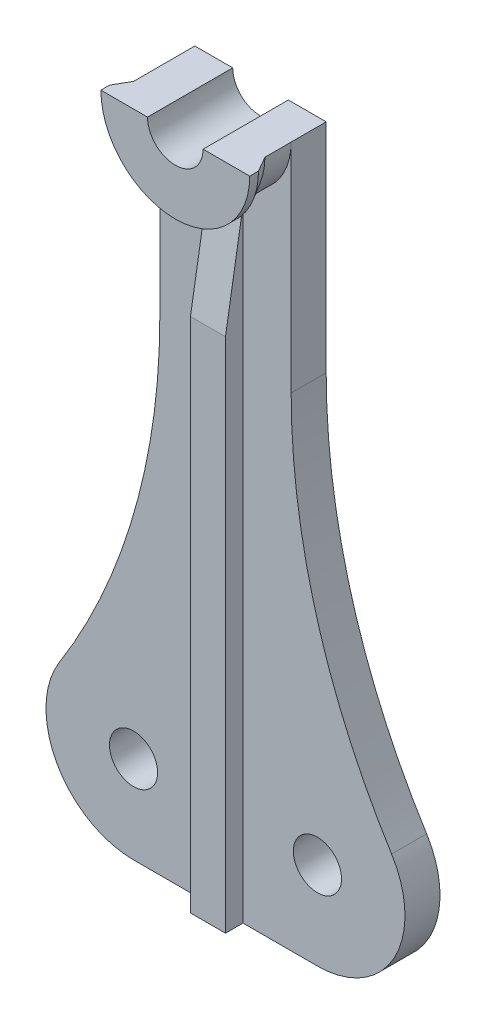
ISO-10303-21;
HEADER;
FILE_DESCRIPTION(('STEP AP214'),'2;1');
FILE_NAME('part.step','',(''),(''),'','','');
FILE_SCHEMA(('AUTOMOTIVE_DESIGN { 1 0 10303 214 1 1 1 1 }'));
ENDSEC;
DATA;
#1=APPLICATION_CONTEXT('core data for automotive mechanical design processes');
#2=APPLICATION_PROTOCOL_DEFINITION('international standard','automotive_design',2000,#1);
#3=PRODUCT_CONTEXT('',#1,'mechanical');
#4=PRODUCT('Part','Part','',(#3));
#5=PRODUCT_RELATED_PRODUCT_CATEGORY('part','',(#4));
#6=PRODUCT_DEFINITION_FORMATION('','',#4);
#7=PRODUCT_DEFINITION_CONTEXT('part definition',#1,'design');
#8=PRODUCT_DEFINITION('design','',#6,#7);
#9=PRODUCT_DEFINITION_SHAPE('','',#8);
#10=(LENGTH_UNIT() NAMED_UNIT(*) SI_UNIT(.MILLI.,.METRE.));
#11=(NAMED_UNIT(*) PLANE_ANGLE_UNIT() SI_UNIT($,.RADIAN.));
#12=(NAMED_UNIT(*) SI_UNIT($,.STERADIAN.) SOLID_ANGLE_UNIT());
#13=UNCERTAINTY_MEASURE_WITH_UNIT(LENGTH_MEASURE(1.E-05),#10,'distance_accuracy_value','');
#14=(GEOMETRIC_REPRESENTATION_CONTEXT(3) GLOBAL_UNCERTAINTY_ASSIGNED_CONTEXT((#13)) GLOBAL_UNIT_ASSIGNED_CONTEXT((#10,
#11,#12)) REPRESENTATION_CONTEXT('',''));
#15=CARTESIAN_POINT('',(0.,0.,0.));
#16=DIRECTION('',(0.,0.,1.));
#17=DIRECTION('',(1.,0.,0.));
#18=AXIS2_PLACEMENT_3D('',#15,#16,#17);
#19=CARTESIAN_POINT('',(-7.5,0.,4.));
#20=DIRECTION('',(1.,0.,0.));
#21=DIRECTION('',(0.,1.,0.));
#22=AXIS2_PLACEMENT_3D('',#19,#20,#21);
#23=PLANE('',#22);
#24=DIRECTION('',(0.,0.,1.));
#25=VECTOR('',#24,1.);
#26=CARTESIAN_POINT('',(-7.50000000000002,-24.8225720076939,-41.4799739066229));
#27=LINE('',#26,#25);
#28=CARTESIAN_POINT('',(-7.5,-24.8225720076939,0.));
#29=VERTEX_POINT('',#28);
#30=CARTESIAN_POINT('',(-7.5,-24.8225720076939,4.));
#31=VERTEX_POINT('',#30);
#32=EDGE_CURVE('E48',#29,#31,#27,.T.);
#33=ORIENTED_EDGE('',*,*,#32,.T.);
#34=DIRECTION('',(0.,-1.,0.));
#35=VECTOR('',#34,1.);
#36=CARTESIAN_POINT('',(-7.5,0.,4.));
#37=LINE('',#36,#35);
#38=CARTESIAN_POINT('',(-7.5,0.,4.));
#39=VERTEX_POINT('',#38);
#40=EDGE_CURVE('E265',#39,#31,#37,.T.);
#41=ORIENTED_EDGE('',*,*,#40,.F.);
#42=DIRECTION('',(0.,0.,-1.));
#43=VECTOR('',#42,1.);
#44=CARTESIAN_POINT('',(-7.5,0.,4.));
#45=LINE('',#44,#43);
#46=CARTESIAN_POINT('',(-7.5,0.,0.));
#47=VERTEX_POINT('',#46);
#48=EDGE_CURVE('E11',#39,#47,#45,.T.);
#49=ORIENTED_EDGE('',*,*,#48,.T.);
#50=DIRECTION('',(0.,-1.,0.));
#51=VECTOR('',#50,1.);
#52=CARTESIAN_POINT('',(-7.5,0.,0.));
#53=LINE('',#52,#51);
#54=EDGE_CURVE('E52',#47,#29,#53,.T.);
#55=ORIENTED_EDGE('',*,*,#54,.T.);
#56=EDGE_LOOP('',(#33,#41,#49,#55));
#57=FACE_BOUND('',#56,.T.);
#58=ADVANCED_FACE('F33',(#57),#23,.F.);
#59=CARTESIAN_POINT('',(-10.5,-70.,4.));
#60=DIRECTION('',(0.,0.,-1.));
#61=DIRECTION('',(-1.,0.,0.));
#62=AXIS2_PLACEMENT_3D('',#59,#60,#61);
#63=CYLINDRICAL_SURFACE('',#62,10.);
#64=DIRECTION('',(0.,0.,1.));
#65=VECTOR('',#64,1.);
#66=CARTESIAN_POINT('',(-18.9705882352941,-64.6850084714934,-41.4799739066229));
#67=LINE('',#66,#65);
#68=CARTESIAN_POINT('',(-18.9705882352941,-64.6850084714934,0.));
#69=VERTEX_POINT('',#68);
#70=CARTESIAN_POINT('',(-18.9705882352941,-64.6850084714934,4.));
#71=VERTEX_POINT('',#70);
#72=EDGE_CURVE('E164',#69,#71,#67,.T.);
#73=ORIENTED_EDGE('',*,*,#72,.F.);
#74=CARTESIAN_POINT('',(-10.5,-70.,0.));
#75=DIRECTION('',(0.,0.,1.));
#76=DIRECTION('',(1.,0.,0.));
#77=AXIS2_PLACEMENT_3D('',#74,#75,#76);
#78=CIRCLE('',#77,10.);
#79=CARTESIAN_POINT('',(-10.5,-80.,0.));
#80=VERTEX_POINT('',#79);
#81=EDGE_CURVE('E150',#69,#80,#78,.T.);
#82=ORIENTED_EDGE('',*,*,#81,.T.);
#83=DIRECTION('',(0.,0.,-1.));
#84=VECTOR('',#83,1.);
#85=CARTESIAN_POINT('',(-10.5,-80.,4.));
#86=LINE('',#85,#84);
#87=CARTESIAN_POINT('',(-10.5,-80.,4.));
#88=VERTEX_POINT('',#87);
#89=EDGE_CURVE('E41',#88,#80,#86,.T.);
#90=ORIENTED_EDGE('',*,*,#89,.F.);
#91=CARTESIAN_POINT('',(-10.5,-70.,4.));
#92=DIRECTION('',(0.,0.,1.));
#93=DIRECTION('',(1.,0.,0.));
#94=AXIS2_PLACEMENT_3D('',#91,#92,#93);
#95=CIRCLE('',#94,10.);
#96=EDGE_CURVE('E166',#71,#88,#95,.T.);
#97=ORIENTED_EDGE('',*,*,#96,.F.);
#98=EDGE_LOOP('',(#73,#82,#90,#97));
#99=FACE_BOUND('',#98,.T.);
#100=ADVANCED_FACE('F165',(#99),#63,.T.);
#101=CARTESIAN_POINT('',(0.,0.,4.));
#102=DIRECTION('',(0.,0.,1.));
#103=DIRECTION('',(1.,0.,0.));
#104=AXIS2_PLACEMENT_3D('',#101,#102,#103);
#105=PLANE('',#104);
#106=ORIENTED_EDGE('',*,*,#40,.T.);
#107=CARTESIAN_POINT('',(-82.5,-24.8225720076939,4.));
#108=DIRECTION('',(0.,0.,-1.));
#109=DIRECTION('',(1.,0.,0.));
#110=AXIS2_PLACEMENT_3D('',#107,#108,#109);
#111=CIRCLE('',#110,75.);
#112=EDGE_CURVE('E170',#31,#71,#111,.T.);
#113=ORIENTED_EDGE('',*,*,#112,.T.);
#114=ORIENTED_EDGE('',*,*,#96,.T.);
#115=DIRECTION('',(1.,0.,0.));
#116=VECTOR('',#115,1.);
#117=CARTESIAN_POINT('',(10.5,-80.,4.));
#118=LINE('',#117,#116);
#119=CARTESIAN_POINT('',(-2.,-80.,4.));
#120=VERTEX_POINT('',#119);
#121=EDGE_CURVE('E270',#88,#120,#118,.T.);
#122=ORIENTED_EDGE('',*,*,#121,.T.);
#123=DIRECTION('',(0.,1.,0.));
#124=VECTOR('',#123,1.);
#125=CARTESIAN_POINT('',(-2.,-80.,4.));
#126=LINE('',#125,#124);
#127=CARTESIAN_POINT('',(-2.,-9.,4.));
#128=VERTEX_POINT('',#127);
#129=EDGE_CURVE('E183',#120,#128,#126,.T.);
#130=ORIENTED_EDGE('',*,*,#129,.T.);
#131=DIRECTION('',(-1.,0.,0.));
#132=VECTOR('',#131,1.);
#133=CARTESIAN_POINT('',(2.,-9.,4.));
#134=LINE('',#133,#132);
#135=CARTESIAN_POINT('',(2.,-9.,4.));
#136=VERTEX_POINT('',#135);
#137=EDGE_CURVE('E213',#136,#128,#134,.T.);
#138=ORIENTED_EDGE('',*,*,#137,.F.);
#139=DIRECTION('',(0.,1.,0.));
#140=VECTOR('',#139,1.);
#141=CARTESIAN_POINT('',(2.,-80.,4.));
#142=LINE('',#141,#140);
#143=CARTESIAN_POINT('',(2.,-80.,4.));
#144=VERTEX_POINT('',#143);
#145=EDGE_CURVE('E189',#144,#136,#142,.T.);
#146=ORIENTED_EDGE('',*,*,#145,.F.);
#147=CARTESIAN_POINT('',(10.5,-80.,4.));
#148=VERTEX_POINT('',#147);
#149=EDGE_CURVE('E269',#144,#148,#118,.T.);
#150=ORIENTED_EDGE('',*,*,#149,.T.);
#151=CARTESIAN_POINT('',(10.5,-70.,4.));
#152=DIRECTION('',(0.,0.,1.));
#153=DIRECTION('',(1.,0.,0.));
#154=AXIS2_PLACEMENT_3D('',#151,#152,#153);
#155=CIRCLE('',#154,10.);
#156=CARTESIAN_POINT('',(18.9705882352941,-64.6850084714934,4.));
#157=VERTEX_POINT('',#156);
#158=EDGE_CURVE('E272',#148,#157,#155,.T.);
#159=ORIENTED_EDGE('',*,*,#158,.T.);
#160=CARTESIAN_POINT('',(82.5,-24.8225720076939,4.));
#161=DIRECTION('',(0.,0.,-1.));
#162=DIRECTION('',(1.,0.,0.));
#163=AXIS2_PLACEMENT_3D('',#160,#161,#162);
#164=CIRCLE('',#163,75.);
#165=CARTESIAN_POINT('',(7.5,-24.8225720076939,4.));
#166=VERTEX_POINT('',#165);
#167=EDGE_CURVE('E173',#157,#166,#164,.T.);
#168=ORIENTED_EDGE('',*,*,#167,.T.);
#169=DIRECTION('',(0.,1.,0.));
#170=VECTOR('',#169,1.);
#171=CARTESIAN_POINT('',(7.5,0.,4.));
#172=LINE('',#171,#170);
#173=CARTESIAN_POINT('',(7.5,0.,4.));
#174=VERTEX_POINT('',#173);
#175=EDGE_CURVE('E275',#166,#174,#172,.T.);
#176=ORIENTED_EDGE('',*,*,#175,.T.);
#177=CARTESIAN_POINT('',(0.,0.,4.));
#178=DIRECTION('',(0.,0.,1.));
#179=DIRECTION('',(1.,0.,0.));
#180=AXIS2_PLACEMENT_3D('',#177,#178,#179);
#181=CIRCLE('',#180,7.5);
#182=EDGE_CURVE('E249',#39,#174,#181,.T.);
#183=ORIENTED_EDGE('',*,*,#182,.F.);
#184=EDGE_LOOP('',(#106,#113,#114,#122,#130,#138,#146,#150,#159,#168,#176,#183));
#185=FACE_BOUND('',#184,.T.);
#186=CARTESIAN_POINT('',(10.5,-70.,4.));
#187=DIRECTION('',(0.,0.,1.));
#188=DIRECTION('',(1.,0.,0.));
#189=AXIS2_PLACEMENT_3D('',#186,#187,#188);
#190=CIRCLE('',#189,2.75);
#191=CARTESIAN_POINT('',(13.25,-70.,4.));
#192=VERTEX_POINT('',#191);
#193=EDGE_CURVE('E253',#192,#192,#190,.T.);
#194=ORIENTED_EDGE('',*,*,#193,.F.);
#195=EDGE_LOOP('',(#194));
#196=FACE_BOUND('',#195,.T.);
#197=CARTESIAN_POINT('',(-10.5,-70.,4.));
#198=DIRECTION('',(0.,0.,1.));
#199=DIRECTION('',(1.,0.,0.));
#200=AXIS2_PLACEMENT_3D('',#197,#198,#199);
#201=CIRCLE('',#200,2.75);
#202=CARTESIAN_POINT('',(-7.74999999999999,-70.,4.));
#203=VERTEX_POINT('',#202);
#204=EDGE_CURVE('E259',#203,#203,#201,.T.);
#205=ORIENTED_EDGE('',*,*,#204,.F.);
#206=EDGE_LOOP('',(#205));
#207=FACE_BOUND('',#206,.T.);
#208=ADVANCED_FACE('F306',(#185,#196,#207),#105,.T.);
#209=CARTESIAN_POINT('',(0.,0.,0.));
#210=DIRECTION('',(0.,0.,1.));
#211=DIRECTION('',(1.,0.,0.));
#212=AXIS2_PLACEMENT_3D('',#209,#210,#211);
#213=PLANE('',#212);
#214=CARTESIAN_POINT('',(-10.5,-70.,0.));
#215=DIRECTION('',(0.,0.,1.));
#216=DIRECTION('',(1.,0.,0.));
#217=AXIS2_PLACEMENT_3D('',#214,#215,#216);
#218=CIRCLE('',#217,2.75);
#219=CARTESIAN_POINT('',(-7.74999999999999,-70.,0.));
#220=VERTEX_POINT('',#219);
#221=EDGE_CURVE('E256',#220,#220,#218,.T.);
#222=ORIENTED_EDGE('',*,*,#221,.T.);
#223=EDGE_LOOP('',(#222));
#224=FACE_BOUND('',#223,.T.);
#225=DIRECTION('',(-1.,0.,0.));
#226=VECTOR('',#225,1.);
#227=CARTESIAN_POINT('',(-7.5,0.,0.));
#228=LINE('',#227,#226);
#229=CARTESIAN_POINT('',(-3.175,0.,0.));
#230=VERTEX_POINT('',#229);
#231=EDGE_CURVE('E262',#230,#47,#228,.T.);
#232=ORIENTED_EDGE('',*,*,#231,.F.);
#233=CARTESIAN_POINT('',(0.,0.,0.));
#234=DIRECTION('',(0.,0.,-1.));
#235=DIRECTION('',(1.,0.,0.));
#236=AXIS2_PLACEMENT_3D('',#233,#234,#235);
#237=CIRCLE('',#236,3.175);
#238=CARTESIAN_POINT('',(3.175,0.,0.));
#239=VERTEX_POINT('',#238);
#240=EDGE_CURVE('E267',#239,#230,#237,.T.);
#241=ORIENTED_EDGE('',*,*,#240,.F.);
#242=DIRECTION('',(-1.,0.,0.));
#243=VECTOR('',#242,1.);
#244=CARTESIAN_POINT('',(3.175,0.,0.));
#245=LINE('',#244,#243);
#246=CARTESIAN_POINT('',(7.5,0.,0.));
#247=VERTEX_POINT('',#246);
#248=EDGE_CURVE('E286',#247,#239,#245,.T.);
#249=ORIENTED_EDGE('',*,*,#248,.F.);
#250=DIRECTION('',(0.,1.,0.));
#251=VECTOR('',#250,1.);
#252=CARTESIAN_POINT('',(7.5,0.,0.));
#253=LINE('',#252,#251);
#254=CARTESIAN_POINT('',(7.50000000000003,-24.8225720076939,0.));
#255=VERTEX_POINT('',#254);
#256=EDGE_CURVE('E284',#255,#247,#253,.T.);
#257=ORIENTED_EDGE('',*,*,#256,.F.);
#258=CARTESIAN_POINT('',(82.5,-24.8225720076939,0.));
#259=DIRECTION('',(0.,0.,1.));
#260=DIRECTION('',(1.,0.,0.));
#261=AXIS2_PLACEMENT_3D('',#258,#259,#260);
#262=CIRCLE('',#261,75.);
#263=CARTESIAN_POINT('',(18.9705882352941,-64.6850084714934,0.));
#264=VERTEX_POINT('',#263);
#265=EDGE_CURVE('E181',#255,#264,#262,.T.);
#266=ORIENTED_EDGE('',*,*,#265,.T.);
#267=CARTESIAN_POINT('',(10.5,-70.,0.));
#268=DIRECTION('',(0.,0.,1.));
#269=DIRECTION('',(1.,0.,0.));
#270=AXIS2_PLACEMENT_3D('',#267,#268,#269);
#271=CIRCLE('',#270,10.);
#272=CARTESIAN_POINT('',(10.5,-80.,0.));
#273=VERTEX_POINT('',#272);
#274=EDGE_CURVE('E282',#273,#264,#271,.T.);
#275=ORIENTED_EDGE('',*,*,#274,.F.);
#276=DIRECTION('',(1.,0.,0.));
#277=VECTOR('',#276,1.);
#278=CARTESIAN_POINT('',(10.5,-80.,0.));
#279=LINE('',#278,#277);
#280=EDGE_CURVE('E158',#80,#273,#279,.T.);
#281=ORIENTED_EDGE('',*,*,#280,.F.);
#282=ORIENTED_EDGE('',*,*,#81,.F.);
#283=CARTESIAN_POINT('',(-82.5,-24.8225720076939,0.));
#284=DIRECTION('',(0.,0.,1.));
#285=DIRECTION('',(1.,0.,0.));
#286=AXIS2_PLACEMENT_3D('',#283,#284,#285);
#287=CIRCLE('',#286,75.);
#288=EDGE_CURVE('E156',#69,#29,#287,.T.);
#289=ORIENTED_EDGE('',*,*,#288,.T.);
#290=ORIENTED_EDGE('',*,*,#54,.F.);
#291=EDGE_LOOP('',(#232,#241,#249,#257,#266,#275,#281,#282,#289,#290));
#292=FACE_BOUND('',#291,.T.);
#293=CARTESIAN_POINT('',(10.5,-70.,0.));
#294=DIRECTION('',(0.,0.,1.));
#295=DIRECTION('',(1.,0.,0.));
#296=AXIS2_PLACEMENT_3D('',#293,#294,#295);
#297=CIRCLE('',#296,2.75);
#298=CARTESIAN_POINT('',(13.25,-70.,0.));
#299=VERTEX_POINT('',#298);
#300=EDGE_CURVE('E252',#299,#299,#297,.T.);
#301=ORIENTED_EDGE('',*,*,#300,.T.);
#302=EDGE_LOOP('',(#301));
#303=FACE_BOUND('',#302,.T.);
#304=ADVANCED_FACE('F153',(#224,#292,#303),#213,.F.);
#305=CARTESIAN_POINT('',(-7.5,0.,4.));
#306=DIRECTION('',(0.,-1.,0.));
#307=DIRECTION('',(0.,0.,-1.));
#308=AXIS2_PLACEMENT_3D('',#305,#306,#307);
#309=PLANE('',#308);
#310=ORIENTED_EDGE('',*,*,#231,.T.);
#311=ORIENTED_EDGE('',*,*,#48,.F.);
#312=DIRECTION('',(0.,0.,-1.));
#313=VECTOR('',#312,1.);
#314=CARTESIAN_POINT('',(-7.5,0.,7.));
#315=LINE('',#314,#313);
#316=CARTESIAN_POINT('',(-7.5,0.,7.));
#317=VERTEX_POINT('',#316);
#318=EDGE_CURVE('E228',#317,#39,#315,.T.);
#319=ORIENTED_EDGE('',*,*,#318,.F.);
#320=DIRECTION('',(0.5,0.,-0.866025403784438));
#321=VECTOR('',#320,1.);
#322=CARTESIAN_POINT('',(-8.5,0.,8.73205080756888));
#323=LINE('',#322,#321);
#324=CARTESIAN_POINT('',(-8.5,0.,8.73205080756888));
#325=VERTEX_POINT('',#324);
#326=EDGE_CURVE('E237',#325,#317,#323,.T.);
#327=ORIENTED_EDGE('',*,*,#326,.F.);
#328=DIRECTION('',(0.,0.,-1.));
#329=VECTOR('',#328,1.);
#330=CARTESIAN_POINT('',(-8.5,0.,9.73205080756888));
#331=LINE('',#330,#329);
#332=CARTESIAN_POINT('',(-8.5,0.,9.73205080756888));
#333=VERTEX_POINT('',#332);
#334=EDGE_CURVE('E234',#333,#325,#331,.T.);
#335=ORIENTED_EDGE('',*,*,#334,.F.);
#336=DIRECTION('',(-1.,0.,0.));
#337=VECTOR('',#336,1.);
#338=CARTESIAN_POINT('',(-3.175,0.,9.73205080756888));
#339=LINE('',#338,#337);
#340=CARTESIAN_POINT('',(-3.175,0.,9.73205080756888));
#341=VERTEX_POINT('',#340);
#342=EDGE_CURVE('E231',#341,#333,#339,.T.);
#343=ORIENTED_EDGE('',*,*,#342,.F.);
#344=DIRECTION('',(0.,0.,-1.));
#345=VECTOR('',#344,1.);
#346=CARTESIAN_POINT('',(-3.175,0.,4.));
#347=LINE('',#346,#345);
#348=EDGE_CURVE('E277',#341,#230,#347,.T.);
#349=ORIENTED_EDGE('',*,*,#348,.T.);
#350=EDGE_LOOP('',(#310,#311,#319,#327,#335,#343,#349));
#351=FACE_BOUND('',#350,.T.);
#352=ADVANCED_FACE('F35',(#351),#309,.F.);
#353=CARTESIAN_POINT('',(10.5,-80.,4.));
#354=DIRECTION('',(0.,1.,0.));
#355=DIRECTION('',(0.,0.,1.));
#356=AXIS2_PLACEMENT_3D('',#353,#354,#355);
#357=PLANE('',#356);
#358=ORIENTED_EDGE('',*,*,#280,.T.);
#359=DIRECTION('',(0.,0.,-1.));
#360=VECTOR('',#359,1.);
#361=CARTESIAN_POINT('',(10.5,-80.,4.));
#362=LINE('',#361,#360);
#363=EDGE_CURVE('E297',#148,#273,#362,.T.);
#364=ORIENTED_EDGE('',*,*,#363,.F.);
#365=ORIENTED_EDGE('',*,*,#149,.F.);
#366=DIRECTION('',(0.,0.,-1.));
#367=VECTOR('',#366,1.);
#368=CARTESIAN_POINT('',(2.,-80.,5.99999999999999));
#369=LINE('',#368,#367);
#370=CARTESIAN_POINT('',(2.,-80.,5.99999999999999));
#371=VERTEX_POINT('',#370);
#372=EDGE_CURVE('E197',#371,#144,#369,.T.);
#373=ORIENTED_EDGE('',*,*,#372,.F.);
#374=DIRECTION('',(-1.,0.,0.));
#375=VECTOR('',#374,1.);
#376=CARTESIAN_POINT('',(2.,-80.,5.99999999999999));
#377=LINE('',#376,#375);
#378=CARTESIAN_POINT('',(-2.,-80.,5.99999999999999));
#379=VERTEX_POINT('',#378);
#380=EDGE_CURVE('E200',#371,#379,#377,.T.);
#381=ORIENTED_EDGE('',*,*,#380,.T.);
#382=DIRECTION('',(0.,0.,-1.));
#383=VECTOR('',#382,1.);
#384=CARTESIAN_POINT('',(-2.,-80.,5.99999999999999));
#385=LINE('',#384,#383);
#386=EDGE_CURVE('E193',#379,#120,#385,.T.);
#387=ORIENTED_EDGE('',*,*,#386,.T.);
#388=ORIENTED_EDGE('',*,*,#121,.F.);
#389=ORIENTED_EDGE('',*,*,#89,.T.);
#390=EDGE_LOOP('',(#358,#364,#365,#373,#381,#387,#388,#389));
#391=FACE_BOUND('',#390,.T.);
#392=ADVANCED_FACE('F301',(#391),#357,.F.);
#393=CARTESIAN_POINT('',(10.5,-70.,4.));
#394=DIRECTION('',(0.,0.,-1.));
#395=DIRECTION('',(-1.,0.,0.));
#396=AXIS2_PLACEMENT_3D('',#393,#394,#395);
#397=CYLINDRICAL_SURFACE('',#396,10.);
#398=ORIENTED_EDGE('',*,*,#274,.T.);
#399=DIRECTION('',(0.,0.,1.));
#400=VECTOR('',#399,1.);
#401=CARTESIAN_POINT('',(18.9705882352941,-64.6850084714934,-41.4799739066229));
#402=LINE('',#401,#400);
#403=EDGE_CURVE('E184',#264,#157,#402,.T.);
#404=ORIENTED_EDGE('',*,*,#403,.T.);
#405=ORIENTED_EDGE('',*,*,#158,.F.);
#406=ORIENTED_EDGE('',*,*,#363,.T.);
#407=EDGE_LOOP('',(#398,#404,#405,#406));
#408=FACE_BOUND('',#407,.T.);
#409=ADVANCED_FACE('F344',(#408),#397,.T.);
#410=CARTESIAN_POINT('',(7.5,0.,4.));
#411=DIRECTION('',(-1.,0.,0.));
#412=DIRECTION('',(0.,-1.,0.));
#413=AXIS2_PLACEMENT_3D('',#410,#411,#412);
#414=PLANE('',#413);
#415=ORIENTED_EDGE('',*,*,#175,.F.);
#416=DIRECTION('',(0.,0.,1.));
#417=VECTOR('',#416,1.);
#418=CARTESIAN_POINT('',(7.50000000000003,-24.8225720076939,-41.4799739066229));
#419=LINE('',#418,#417);
#420=EDGE_CURVE('E176',#255,#166,#419,.T.);
#421=ORIENTED_EDGE('',*,*,#420,.F.);
#422=ORIENTED_EDGE('',*,*,#256,.T.);
#423=DIRECTION('',(0.,0.,-1.));
#424=VECTOR('',#423,1.);
#425=CARTESIAN_POINT('',(7.5,0.,4.));
#426=LINE('',#425,#424);
#427=EDGE_CURVE('E294',#174,#247,#426,.T.);
#428=ORIENTED_EDGE('',*,*,#427,.F.);
#429=EDGE_LOOP('',(#415,#421,#422,#428));
#430=FACE_BOUND('',#429,.T.);
#431=ADVANCED_FACE('F337',(#430),#414,.F.);
#432=CARTESIAN_POINT('',(3.175,0.,4.));
#433=DIRECTION('',(0.,-1.,0.));
#434=DIRECTION('',(0.,0.,-1.));
#435=AXIS2_PLACEMENT_3D('',#432,#433,#434);
#436=PLANE('',#435);
#437=ORIENTED_EDGE('',*,*,#248,.T.);
#438=DIRECTION('',(0.,0.,-1.));
#439=VECTOR('',#438,1.);
#440=CARTESIAN_POINT('',(3.175,0.,4.));
#441=LINE('',#440,#439);
#442=CARTESIAN_POINT('',(3.175,0.,9.73205080756888));
#443=VERTEX_POINT('',#442);
#444=EDGE_CURVE('E291',#443,#239,#441,.T.);
#445=ORIENTED_EDGE('',*,*,#444,.F.);
#446=DIRECTION('',(1.,0.,0.));
#447=VECTOR('',#446,1.);
#448=CARTESIAN_POINT('',(3.175,0.,9.73205080756888));
#449=LINE('',#448,#447);
#450=CARTESIAN_POINT('',(8.5,0.,9.73205080756888));
#451=VERTEX_POINT('',#450);
#452=EDGE_CURVE('E219',#443,#451,#449,.T.);
#453=ORIENTED_EDGE('',*,*,#452,.T.);
#454=DIRECTION('',(0.,0.,-1.));
#455=VECTOR('',#454,1.);
#456=CARTESIAN_POINT('',(8.5,0.,9.73205080756888));
#457=LINE('',#456,#455);
#458=CARTESIAN_POINT('',(8.5,0.,8.73205080756888));
#459=VERTEX_POINT('',#458);
#460=EDGE_CURVE('E222',#451,#459,#457,.T.);
#461=ORIENTED_EDGE('',*,*,#460,.T.);
#462=DIRECTION('',(-0.500000000000001,0.,-0.866025403784438));
#463=VECTOR('',#462,1.);
#464=CARTESIAN_POINT('',(8.5,0.,8.73205080756888));
#465=LINE('',#464,#463);
#466=CARTESIAN_POINT('',(7.5,0.,7.));
#467=VERTEX_POINT('',#466);
#468=EDGE_CURVE('E225',#459,#467,#465,.T.);
#469=ORIENTED_EDGE('',*,*,#468,.T.);
#470=DIRECTION('',(0.,0.,-1.));
#471=VECTOR('',#470,1.);
#472=CARTESIAN_POINT('',(7.5,0.,7.));
#473=LINE('',#472,#471);
#474=EDGE_CURVE('E216',#467,#174,#473,.T.);
#475=ORIENTED_EDGE('',*,*,#474,.T.);
#476=ORIENTED_EDGE('',*,*,#427,.T.);
#477=EDGE_LOOP('',(#437,#445,#453,#461,#469,#475,#476));
#478=FACE_BOUND('',#477,.T.);
#479=ADVANCED_FACE('F334',(#478),#436,.F.);
#480=CARTESIAN_POINT('',(0.,0.,4.));
#481=DIRECTION('',(0.,0.,-1.));
#482=DIRECTION('',(-1.,0.,0.));
#483=AXIS2_PLACEMENT_3D('',#480,#481,#482);
#484=CYLINDRICAL_SURFACE('',#483,3.175);
#485=ORIENTED_EDGE('',*,*,#240,.T.);
#486=ORIENTED_EDGE('',*,*,#348,.F.);
#487=CARTESIAN_POINT('',(0.,0.,9.73205080756888));
#488=DIRECTION('',(0.,0.,1.));
#489=DIRECTION('',(1.,0.,0.));
#490=AXIS2_PLACEMENT_3D('',#487,#488,#489);
#491=CIRCLE('',#490,3.175);
#492=EDGE_CURVE('E246',#341,#443,#491,.T.);
#493=ORIENTED_EDGE('',*,*,#492,.T.);
#494=ORIENTED_EDGE('',*,*,#444,.T.);
#495=EDGE_LOOP('',(#485,#486,#493,#494));
#496=FACE_BOUND('',#495,.T.);
#497=ADVANCED_FACE('F329',(#496),#484,.F.);
#498=CARTESIAN_POINT('',(-10.5,-70.,4.));
#499=DIRECTION('',(0.,0.,-1.));
#500=DIRECTION('',(-1.,0.,0.));
#501=AXIS2_PLACEMENT_3D('',#498,#499,#500);
#502=CYLINDRICAL_SURFACE('',#501,2.75);
#503=ORIENTED_EDGE('',*,*,#204,.T.);
#504=EDGE_LOOP('',(#503));
#505=FACE_BOUND('',#504,.T.);
#506=ORIENTED_EDGE('',*,*,#221,.F.);
#507=EDGE_LOOP('',(#506));
#508=FACE_BOUND('',#507,.T.);
#509=ADVANCED_FACE('F387',(#505,#508),#502,.F.);
#510=CARTESIAN_POINT('',(10.5,-70.,4.));
#511=DIRECTION('',(0.,0.,-1.));
#512=DIRECTION('',(-1.,0.,0.));
#513=AXIS2_PLACEMENT_3D('',#510,#511,#512);
#514=CYLINDRICAL_SURFACE('',#513,2.75);
#515=ORIENTED_EDGE('',*,*,#193,.T.);
#516=EDGE_LOOP('',(#515));
#517=FACE_BOUND('',#516,.T.);
#518=ORIENTED_EDGE('',*,*,#300,.F.);
#519=EDGE_LOOP('',(#518));
#520=FACE_BOUND('',#519,.T.);
#521=ADVANCED_FACE('F395',(#517,#520),#514,.F.);
#522=CARTESIAN_POINT('',(0.,0.,0.));
#523=DIRECTION('',(0.,0.,1.));
#524=DIRECTION('',(1.,0.,0.));
#525=AXIS2_PLACEMENT_3D('',#522,#523,#524);
#526=CYLINDRICAL_SURFACE('',#525,7.5);
#527=ORIENTED_EDGE('',*,*,#182,.T.);
#528=ORIENTED_EDGE('',*,*,#474,.F.);
#529=CARTESIAN_POINT('',(0.,0.,7.));
#530=DIRECTION('',(0.,0.,1.));
#531=DIRECTION('',(1.,0.,0.));
#532=AXIS2_PLACEMENT_3D('',#529,#530,#531);
#533=CIRCLE('',#532,7.5);
#534=EDGE_CURVE('E240',#317,#467,#533,.T.);
#535=ORIENTED_EDGE('',*,*,#534,.F.);
#536=ORIENTED_EDGE('',*,*,#318,.T.);
#537=EDGE_LOOP('',(#527,#528,#535,#536));
#538=FACE_BOUND('',#537,.T.);
#539=ADVANCED_FACE('F314',(#538),#526,.T.);
#540=CARTESIAN_POINT('',(-3.175,0.,9.73205080756888));
#541=DIRECTION('',(0.,0.,1.));
#542=DIRECTION('',(1.,0.,0.));
#543=AXIS2_PLACEMENT_3D('',#540,#541,#542);
#544=PLANE('',#543);
#545=CARTESIAN_POINT('',(0.,0.,9.73205080756888));
#546=DIRECTION('',(0.,0.,1.));
#547=DIRECTION('',(1.,0.,0.));
#548=AXIS2_PLACEMENT_3D('',#545,#546,#547);
#549=CIRCLE('',#548,8.5);
#550=EDGE_CURVE('E244',#333,#451,#549,.T.);
#551=ORIENTED_EDGE('',*,*,#550,.T.);
#552=ORIENTED_EDGE('',*,*,#452,.F.);
#553=ORIENTED_EDGE('',*,*,#492,.F.);
#554=ORIENTED_EDGE('',*,*,#342,.T.);
#555=EDGE_LOOP('',(#551,#552,#553,#554));
#556=FACE_BOUND('',#555,.T.);
#557=ADVANCED_FACE('F327',(#556),#544,.T.);
#558=CARTESIAN_POINT('',(0.,0.,0.));
#559=DIRECTION('',(0.,0.,1.));
#560=DIRECTION('',(1.,0.,0.));
#561=AXIS2_PLACEMENT_3D('',#558,#559,#560);
#562=CYLINDRICAL_SURFACE('',#561,8.5);
#563=CARTESIAN_POINT('',(0.,0.,8.73205080756888));
#564=DIRECTION('',(0.,0.,1.));
#565=DIRECTION('',(1.,0.,0.));
#566=AXIS2_PLACEMENT_3D('',#563,#564,#565);
#567=CIRCLE('',#566,8.5);
#568=EDGE_CURVE('E242',#325,#459,#567,.T.);
#569=ORIENTED_EDGE('',*,*,#568,.T.);
#570=ORIENTED_EDGE('',*,*,#460,.F.);
#571=ORIENTED_EDGE('',*,*,#550,.F.);
#572=ORIENTED_EDGE('',*,*,#334,.T.);
#573=EDGE_LOOP('',(#569,#570,#571,#572));
#574=FACE_BOUND('',#573,.T.);
#575=ADVANCED_FACE('F322',(#574),#562,.T.);
#576=CARTESIAN_POINT('',(0.,0.,8.73205080756888));
#577=DIRECTION('',(0.,0.,1.));
#578=DIRECTION('',(1.,0.,0.));
#579=AXIS2_PLACEMENT_3D('',#576,#577,#578);
#580=CONICAL_SURFACE('',#579,8.5,0.5235987755983);
#581=ORIENTED_EDGE('',*,*,#326,.T.);
#582=ORIENTED_EDGE('',*,*,#534,.T.);
#583=ORIENTED_EDGE('',*,*,#468,.F.);
#584=ORIENTED_EDGE('',*,*,#568,.F.);
#585=EDGE_LOOP('',(#581,#582,#583,#584));
#586=FACE_BOUND('',#585,.T.);
#587=ADVANCED_FACE('F318',(#586),#580,.T.);
#588=CARTESIAN_POINT('',(2.,-9.,4.));
#589=DIRECTION('',(0.,-0.164398987305357,-0.986393923832144));
#590=DIRECTION('',(0.,0.986393923832144,-0.164398987305357));
#591=AXIS2_PLACEMENT_3D('',#588,#589,#590);
#592=PLANE('',#591);
#593=DIRECTION('',(0.,-0.986393923832144,0.164398987305357));
#594=VECTOR('',#593,1.);
#595=CARTESIAN_POINT('',(-2.,-9.,4.));
#596=LINE('',#595,#594);
#597=CARTESIAN_POINT('',(-2.,-21.,6.));
#598=VERTEX_POINT('',#597);
#599=EDGE_CURVE('E202',#128,#598,#596,.T.);
#600=ORIENTED_EDGE('',*,*,#599,.T.);
#601=DIRECTION('',(-1.,0.,0.));
#602=VECTOR('',#601,1.);
#603=CARTESIAN_POINT('',(2.,-21.,6.));
#604=LINE('',#603,#602);
#605=CARTESIAN_POINT('',(2.,-21.,6.));
#606=VERTEX_POINT('',#605);
#607=EDGE_CURVE('E210',#606,#598,#604,.T.);
#608=ORIENTED_EDGE('',*,*,#607,.F.);
#609=DIRECTION('',(0.,-0.986393923832144,0.164398987305357));
#610=VECTOR('',#609,1.);
#611=CARTESIAN_POINT('',(2.,-9.,4.));
#612=LINE('',#611,#610);
#613=EDGE_CURVE('E192',#136,#606,#612,.T.);
#614=ORIENTED_EDGE('',*,*,#613,.F.);
#615=ORIENTED_EDGE('',*,*,#137,.T.);
#616=EDGE_LOOP('',(#600,#608,#614,#615));
#617=FACE_BOUND('',#616,.T.);
#618=ADVANCED_FACE('F360',(#617),#592,.F.);
#619=CARTESIAN_POINT('',(2.,-21.,6.));
#620=DIRECTION('',(0.,0.,-1.));
#621=DIRECTION('',(0.,1.,0.));
#622=AXIS2_PLACEMENT_3D('',#619,#620,#621);
#623=PLANE('',#622);
#624=DIRECTION('',(0.,-1.,0.));
#625=VECTOR('',#624,1.);
#626=CARTESIAN_POINT('',(-2.,-21.,6.));
#627=LINE('',#626,#625);
#628=EDGE_CURVE('E204',#598,#379,#627,.T.);
#629=ORIENTED_EDGE('',*,*,#628,.T.);
#630=ORIENTED_EDGE('',*,*,#380,.F.);
#631=DIRECTION('',(0.,-1.,0.));
#632=VECTOR('',#631,1.);
#633=CARTESIAN_POINT('',(2.,-21.,6.));
#634=LINE('',#633,#632);
#635=EDGE_CURVE('E195',#606,#371,#634,.T.);
#636=ORIENTED_EDGE('',*,*,#635,.F.);
#637=ORIENTED_EDGE('',*,*,#607,.T.);
#638=EDGE_LOOP('',(#629,#630,#636,#637));
#639=FACE_BOUND('',#638,.T.);
#640=ADVANCED_FACE('F355',(#639),#623,.F.);
#641=CARTESIAN_POINT('',(2.,-80.,4.));
#642=DIRECTION('',(-1.,0.,0.));
#643=DIRECTION('',(0.,0.,1.));
#644=AXIS2_PLACEMENT_3D('',#641,#642,#643);
#645=PLANE('',#644);
#646=ORIENTED_EDGE('',*,*,#145,.T.);
#647=ORIENTED_EDGE('',*,*,#613,.T.);
#648=ORIENTED_EDGE('',*,*,#635,.T.);
#649=ORIENTED_EDGE('',*,*,#372,.T.);
#650=EDGE_LOOP('',(#646,#647,#648,#649));
#651=FACE_BOUND('',#650,.T.);
#652=ADVANCED_FACE('F350',(#651),#645,.F.);
#653=CARTESIAN_POINT('',(-2.,-80.,4.));
#654=DIRECTION('',(-1.,0.,0.));
#655=DIRECTION('',(0.,0.,1.));
#656=AXIS2_PLACEMENT_3D('',#653,#654,#655);
#657=PLANE('',#656);
#658=ORIENTED_EDGE('',*,*,#129,.F.);
#659=ORIENTED_EDGE('',*,*,#386,.F.);
#660=ORIENTED_EDGE('',*,*,#628,.F.);
#661=ORIENTED_EDGE('',*,*,#599,.F.);
#662=EDGE_LOOP('',(#658,#659,#660,#661));
#663=FACE_BOUND('',#662,.T.);
#664=ADVANCED_FACE('F358',(#663),#657,.T.);
#665=CARTESIAN_POINT('',(82.5,-24.8225720076939,-41.4799739066229));
#666=DIRECTION('',(0.,0.,1.));
#667=DIRECTION('',(1.,0.,0.));
#668=AXIS2_PLACEMENT_3D('',#665,#666,#667);
#669=CYLINDRICAL_SURFACE('',#668,75.);
#670=ORIENTED_EDGE('',*,*,#265,.F.);
#671=ORIENTED_EDGE('',*,*,#420,.T.);
#672=ORIENTED_EDGE('',*,*,#167,.F.);
#673=ORIENTED_EDGE('',*,*,#403,.F.);
#674=EDGE_LOOP('',(#670,#671,#672,#673));
#675=FACE_BOUND('',#674,.T.);
#676=ADVANCED_FACE('F342',(#675),#669,.F.);
#677=CARTESIAN_POINT('',(-82.5,-24.8225720076939,-41.4799739066229));
#678=DIRECTION('',(0.,0.,1.));
#679=DIRECTION('',(1.,0.,0.));
#680=AXIS2_PLACEMENT_3D('',#677,#678,#679);
#681=CYLINDRICAL_SURFACE('',#680,75.);
#682=ORIENTED_EDGE('',*,*,#288,.F.);
#683=ORIENTED_EDGE('',*,*,#72,.T.);
#684=ORIENTED_EDGE('',*,*,#112,.F.);
#685=ORIENTED_EDGE('',*,*,#32,.F.);
#686=EDGE_LOOP('',(#682,#683,#684,#685));
#687=FACE_BOUND('',#686,.T.);
#688=ADVANCED_FACE('F172',(#687),#681,.F.);
#689=CLOSED_SHELL('',(#58,#100,#208,#304,#352,#392,#409,#431,#479,#497,#509,#521,#539,#557,#575,
#587,#618,#640,#652,#664,#676,#688));
#690=MANIFOLD_SOLID_BREP('B2',#689);
#691=ADVANCED_BREP_SHAPE_REPRESENTATION('',(#18,#690),#14);
#692=SHAPE_DEFINITION_REPRESENTATION(#9,#691);
ENDSEC;
END-ISO-10303-21;
